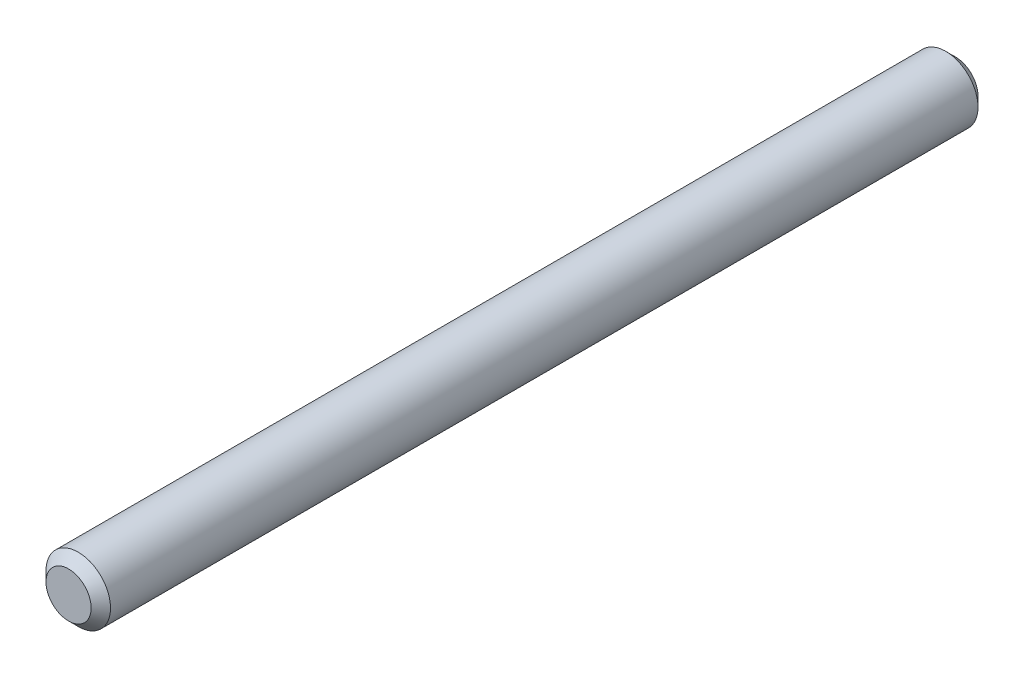
ISO-10303-21;
HEADER;
FILE_DESCRIPTION(('STEP AP214'),'2;1');
FILE_NAME('part.step','',(''),(''),'','','');
FILE_SCHEMA(('AUTOMOTIVE_DESIGN { 1 0 10303 214 1 1 1 1 }'));
ENDSEC;
DATA;
#1=APPLICATION_CONTEXT('core data for automotive mechanical design processes');
#2=APPLICATION_PROTOCOL_DEFINITION('international standard','automotive_design',2000,#1);
#3=PRODUCT_CONTEXT('',#1,'mechanical');
#4=PRODUCT('Part','Part','',(#3));
#5=PRODUCT_RELATED_PRODUCT_CATEGORY('part','',(#4));
#6=PRODUCT_DEFINITION_FORMATION('','',#4);
#7=PRODUCT_DEFINITION_CONTEXT('part definition',#1,'design');
#8=PRODUCT_DEFINITION('design','',#6,#7);
#9=PRODUCT_DEFINITION_SHAPE('','',#8);
#10=(LENGTH_UNIT() NAMED_UNIT(*) SI_UNIT(.MILLI.,.METRE.));
#11=(NAMED_UNIT(*) PLANE_ANGLE_UNIT() SI_UNIT($,.RADIAN.));
#12=(NAMED_UNIT(*) SI_UNIT($,.STERADIAN.) SOLID_ANGLE_UNIT());
#13=UNCERTAINTY_MEASURE_WITH_UNIT(LENGTH_MEASURE(1.E-05),#10,'distance_accuracy_value','');
#14=(GEOMETRIC_REPRESENTATION_CONTEXT(3) GLOBAL_UNCERTAINTY_ASSIGNED_CONTEXT((#13)) GLOBAL_UNIT_ASSIGNED_CONTEXT((#10,
#11,#12)) REPRESENTATION_CONTEXT('',''));
#15=CARTESIAN_POINT('',(0.,0.,0.));
#16=DIRECTION('',(0.,0.,1.));
#17=DIRECTION('',(1.,0.,0.));
#18=AXIS2_PLACEMENT_3D('',#15,#16,#17);
#19=CARTESIAN_POINT('',(0.,0.,-13.75));
#20=DIRECTION('',(0.,0.,1.));
#21=DIRECTION('',(1.,0.,0.));
#22=AXIS2_PLACEMENT_3D('',#19,#20,#21);
#23=PLANE('',#22);
#24=CARTESIAN_POINT('',(0.,0.,-13.7500000000159));
#25=DIRECTION('',(0.,0.,1.));
#26=DIRECTION('',(1.,0.,0.));
#27=AXIS2_PLACEMENT_3D('',#24,#25,#26);
#28=CIRCLE('',#27,0.699985556138927);
#29=CARTESIAN_POINT('',(0.699985556138927,0.,-13.7500000000159));
#30=VERTEX_POINT('',#29);
#31=EDGE_CURVE('E18',#30,#30,#28,.T.);
#32=ORIENTED_EDGE('',*,*,#31,.F.);
#33=EDGE_LOOP('',(#32));
#34=FACE_BOUND('',#33,.T.);
#35=ADVANCED_FACE('F15',(#34),#23,.F.);
#36=CARTESIAN_POINT('',(0.,0.,13.75));
#37=DIRECTION('',(0.,0.,1.));
#38=DIRECTION('',(1.,0.,0.));
#39=AXIS2_PLACEMENT_3D('',#36,#37,#38);
#40=PLANE('',#39);
#41=CARTESIAN_POINT('',(0.,0.,13.7500000000159));
#42=DIRECTION('',(0.,0.,-1.));
#43=DIRECTION('',(-1.,0.,0.));
#44=AXIS2_PLACEMENT_3D('',#41,#42,#43);
#45=CIRCLE('',#44,0.699985556138927);
#46=CARTESIAN_POINT('',(-0.699985556138927,0.,13.7500000000159));
#47=VERTEX_POINT('',#46);
#48=EDGE_CURVE('E27',#47,#47,#45,.T.);
#49=ORIENTED_EDGE('',*,*,#48,.F.);
#50=EDGE_LOOP('',(#49));
#51=FACE_BOUND('',#50,.T.);
#52=ADVANCED_FACE('F38',(#51),#40,.T.);
#53=CARTESIAN_POINT('',(0.,0.,-13.4499793654754));
#54=DIRECTION('',(0.,0.,1.));
#55=DIRECTION('',(1.,0.,0.));
#56=AXIS2_PLACEMENT_3D('',#53,#54,#55);
#57=CONICAL_SURFACE('',#56,0.999999999976353,0.7853878461622);
#58=CARTESIAN_POINT('',(0.,0.,-13.449979365443));
#59=DIRECTION('',(0.,0.,1.));
#60=DIRECTION('',(1.,0.,0.));
#61=AXIS2_PLACEMENT_3D('',#58,#59,#60);
#62=CIRCLE('',#61,1.);
#63=CARTESIAN_POINT('',(1.,0.,-13.449979365443));
#64=VERTEX_POINT('',#63);
#65=EDGE_CURVE('E22',#64,#64,#62,.T.);
#66=ORIENTED_EDGE('',*,*,#65,.F.);
#67=EDGE_LOOP('',(#66));
#68=FACE_BOUND('',#67,.T.);
#69=ORIENTED_EDGE('',*,*,#31,.T.);
#70=EDGE_LOOP('',(#69));
#71=FACE_BOUND('',#70,.T.);
#72=ADVANCED_FACE('F35',(#68,#71),#57,.T.);
#73=CARTESIAN_POINT('',(0.,0.,13.4499793654754));
#74=DIRECTION('',(0.,0.,-1.));
#75=DIRECTION('',(-1.,0.,0.));
#76=AXIS2_PLACEMENT_3D('',#73,#74,#75);
#77=CONICAL_SURFACE('',#76,0.999999999976353,0.7853878461622);
#78=CARTESIAN_POINT('',(0.,0.,13.449979365443));
#79=DIRECTION('',(0.,0.,1.));
#80=DIRECTION('',(1.,0.,0.));
#81=AXIS2_PLACEMENT_3D('',#78,#79,#80);
#82=CIRCLE('',#81,1.);
#83=CARTESIAN_POINT('',(1.,0.,13.449979365443));
#84=VERTEX_POINT('',#83);
#85=EDGE_CURVE('E10',#84,#84,#82,.F.);
#86=ORIENTED_EDGE('',*,*,#85,.F.);
#87=EDGE_LOOP('',(#86));
#88=FACE_BOUND('',#87,.T.);
#89=ORIENTED_EDGE('',*,*,#48,.T.);
#90=EDGE_LOOP('',(#89));
#91=FACE_BOUND('',#90,.T.);
#92=ADVANCED_FACE('F46',(#88,#91),#77,.T.);
#93=CARTESIAN_POINT('',(0.,0.,-13.75));
#94=DIRECTION('',(0.,0.,1.));
#95=DIRECTION('',(1.,0.,0.));
#96=AXIS2_PLACEMENT_3D('',#93,#94,#95);
#97=CYLINDRICAL_SURFACE('',#96,1.);
#98=ORIENTED_EDGE('',*,*,#85,.T.);
#99=EDGE_LOOP('',(#98));
#100=FACE_BOUND('',#99,.T.);
#101=ORIENTED_EDGE('',*,*,#65,.T.);
#102=EDGE_LOOP('',(#101));
#103=FACE_BOUND('',#102,.T.);
#104=ADVANCED_FACE('F44',(#100,#103),#97,.T.);
#105=CLOSED_SHELL('',(#35,#52,#72,#92,#104));
#106=MANIFOLD_SOLID_BREP('B1',#105);
#107=ADVANCED_BREP_SHAPE_REPRESENTATION('',(#18,#106),#14);
#108=SHAPE_DEFINITION_REPRESENTATION(#9,#107);
ENDSEC;
END-ISO-10303-21;
